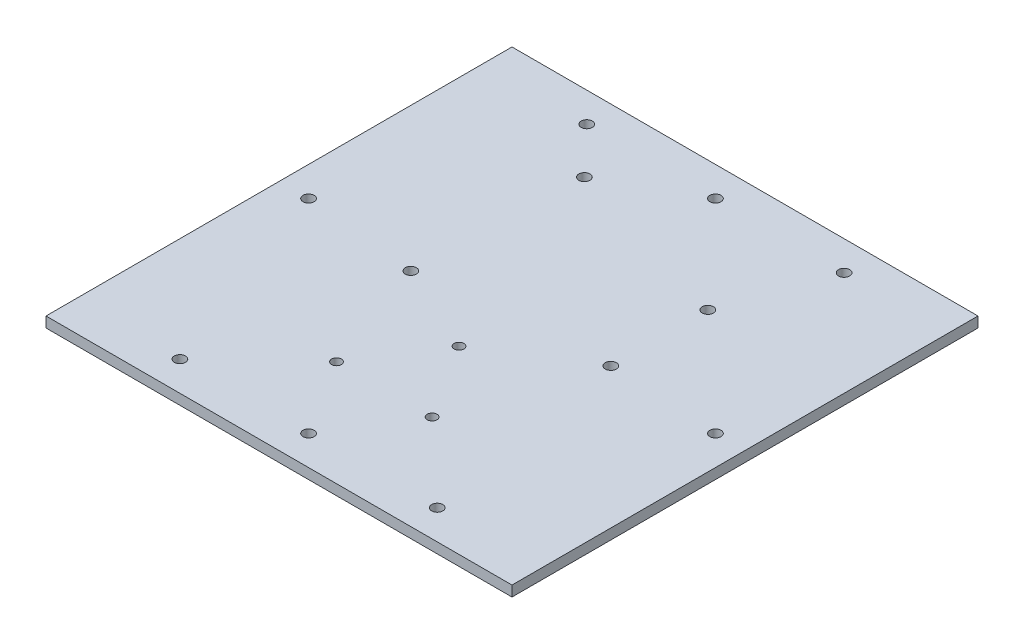
ISO-10303-21;
HEADER;
FILE_DESCRIPTION(('STEP AP214'),'2;1');
FILE_NAME('part.step','',(''),(''),'','','');
FILE_SCHEMA(('AUTOMOTIVE_DESIGN { 1 0 10303 214 1 1 1 1 }'));
ENDSEC;
DATA;
#1=APPLICATION_CONTEXT('core data for automotive mechanical design processes');
#2=APPLICATION_PROTOCOL_DEFINITION('international standard','automotive_design',2000,#1);
#3=PRODUCT_CONTEXT('',#1,'mechanical');
#4=PRODUCT('Part','Part','',(#3));
#5=PRODUCT_RELATED_PRODUCT_CATEGORY('part','',(#4));
#6=PRODUCT_DEFINITION_FORMATION('','',#4);
#7=PRODUCT_DEFINITION_CONTEXT('part definition',#1,'design');
#8=PRODUCT_DEFINITION('design','',#6,#7);
#9=PRODUCT_DEFINITION_SHAPE('','',#8);
#10=(LENGTH_UNIT() NAMED_UNIT(*) SI_UNIT(.MILLI.,.METRE.));
#11=(NAMED_UNIT(*) PLANE_ANGLE_UNIT() SI_UNIT($,.RADIAN.));
#12=(NAMED_UNIT(*) SI_UNIT($,.STERADIAN.) SOLID_ANGLE_UNIT());
#13=UNCERTAINTY_MEASURE_WITH_UNIT(LENGTH_MEASURE(1.E-05),#10,'distance_accuracy_value','');
#14=(GEOMETRIC_REPRESENTATION_CONTEXT(3) GLOBAL_UNCERTAINTY_ASSIGNED_CONTEXT((#13)) GLOBAL_UNIT_ASSIGNED_CONTEXT((#10,
#11,#12)) REPRESENTATION_CONTEXT('',''));
#15=CARTESIAN_POINT('',(0.,0.,0.));
#16=DIRECTION('',(0.,0.,1.));
#17=DIRECTION('',(1.,0.,0.));
#18=AXIS2_PLACEMENT_3D('',#15,#16,#17);
#19=CARTESIAN_POINT('',(67.,3.,0.));
#20=DIRECTION('',(1.,0.,0.));
#21=DIRECTION('',(0.,0.,-1.));
#22=AXIS2_PLACEMENT_3D('',#19,#20,#21);
#23=PLANE('',#22);
#24=DIRECTION('',(0.,0.,1.));
#25=VECTOR('',#24,1.);
#26=CARTESIAN_POINT('',(67.,0.,0.));
#27=LINE('',#26,#25);
#28=CARTESIAN_POINT('',(67.,0.,-67.));
#29=VERTEX_POINT('',#28);
#30=CARTESIAN_POINT('',(67.,0.,67.));
#31=VERTEX_POINT('',#30);
#32=EDGE_CURVE('E152',#29,#31,#27,.T.);
#33=ORIENTED_EDGE('',*,*,#32,.F.);
#34=DIRECTION('',(0.,-1.,0.));
#35=VECTOR('',#34,1.);
#36=CARTESIAN_POINT('',(67.,3.,-67.));
#37=LINE('',#36,#35);
#38=CARTESIAN_POINT('',(67.,3.,-67.));
#39=VERTEX_POINT('',#38);
#40=EDGE_CURVE('E11',#39,#29,#37,.T.);
#41=ORIENTED_EDGE('',*,*,#40,.F.);
#42=DIRECTION('',(0.,0.,1.));
#43=VECTOR('',#42,1.);
#44=CARTESIAN_POINT('',(67.,3.,0.));
#45=LINE('',#44,#43);
#46=CARTESIAN_POINT('',(67.,3.,67.));
#47=VERTEX_POINT('',#46);
#48=EDGE_CURVE('E100',#39,#47,#45,.T.);
#49=ORIENTED_EDGE('',*,*,#48,.T.);
#50=DIRECTION('',(0.,-1.,0.));
#51=VECTOR('',#50,1.);
#52=CARTESIAN_POINT('',(67.,3.,67.));
#53=LINE('',#52,#51);
#54=EDGE_CURVE('E78',#47,#31,#53,.T.);
#55=ORIENTED_EDGE('',*,*,#54,.T.);
#56=EDGE_LOOP('',(#33,#41,#49,#55));
#57=FACE_BOUND('',#56,.T.);
#58=ADVANCED_FACE('F38',(#57),#23,.T.);
#59=CARTESIAN_POINT('',(0.,3.,-66.9999999999999));
#60=DIRECTION('',(0.,0.,-1.));
#61=DIRECTION('',(-1.,0.,0.));
#62=AXIS2_PLACEMENT_3D('',#59,#60,#61);
#63=PLANE('',#62);
#64=DIRECTION('',(1.,0.,0.));
#65=VECTOR('',#64,1.);
#66=CARTESIAN_POINT('',(0.,0.,-66.9999999999999));
#67=LINE('',#66,#65);
#68=CARTESIAN_POINT('',(-67.0000000000002,0.,-66.9999999999999));
#69=VERTEX_POINT('',#68);
#70=EDGE_CURVE('E90',#69,#29,#67,.T.);
#71=ORIENTED_EDGE('',*,*,#70,.F.);
#72=DIRECTION('',(0.,-1.,0.));
#73=VECTOR('',#72,1.);
#74=CARTESIAN_POINT('',(-67.0000000000002,3.,-66.9999999999999));
#75=LINE('',#74,#73);
#76=CARTESIAN_POINT('',(-67.0000000000002,3.,-66.9999999999999));
#77=VERTEX_POINT('',#76);
#78=EDGE_CURVE('E47',#77,#69,#75,.T.);
#79=ORIENTED_EDGE('',*,*,#78,.F.);
#80=DIRECTION('',(1.,0.,0.));
#81=VECTOR('',#80,1.);
#82=CARTESIAN_POINT('',(0.,3.,-66.9999999999999));
#83=LINE('',#82,#81);
#84=EDGE_CURVE('E88',#77,#39,#83,.T.);
#85=ORIENTED_EDGE('',*,*,#84,.T.);
#86=ORIENTED_EDGE('',*,*,#40,.T.);
#87=EDGE_LOOP('',(#71,#79,#85,#86));
#88=FACE_BOUND('',#87,.T.);
#89=ADVANCED_FACE('F86',(#88),#63,.T.);
#90=CARTESIAN_POINT('',(-67.0000000000001,3.,0.));
#91=DIRECTION('',(1.,0.,0.));
#92=DIRECTION('',(0.,0.,-1.));
#93=AXIS2_PLACEMENT_3D('',#90,#91,#92);
#94=PLANE('',#93);
#95=DIRECTION('',(0.,0.,1.));
#96=VECTOR('',#95,1.);
#97=CARTESIAN_POINT('',(-67.0000000000001,0.,0.));
#98=LINE('',#97,#96);
#99=CARTESIAN_POINT('',(-67.,0.,67.));
#100=VERTEX_POINT('',#99);
#101=EDGE_CURVE('E155',#69,#100,#98,.T.);
#102=ORIENTED_EDGE('',*,*,#101,.T.);
#103=DIRECTION('',(0.,-1.,0.));
#104=VECTOR('',#103,1.);
#105=CARTESIAN_POINT('',(-67.,3.,67.));
#106=LINE('',#105,#104);
#107=CARTESIAN_POINT('',(-67.,3.,67.));
#108=VERTEX_POINT('',#107);
#109=EDGE_CURVE('E93',#108,#100,#106,.T.);
#110=ORIENTED_EDGE('',*,*,#109,.F.);
#111=DIRECTION('',(0.,0.,1.));
#112=VECTOR('',#111,1.);
#113=CARTESIAN_POINT('',(-67.0000000000001,3.,0.));
#114=LINE('',#113,#112);
#115=EDGE_CURVE('E95',#77,#108,#114,.T.);
#116=ORIENTED_EDGE('',*,*,#115,.F.);
#117=ORIENTED_EDGE('',*,*,#78,.T.);
#118=EDGE_LOOP('',(#102,#110,#116,#117));
#119=FACE_BOUND('',#118,.T.);
#120=ADVANCED_FACE('F96',(#119),#94,.F.);
#121=CARTESIAN_POINT('',(-13.8303840868332,3.,36.6434533604129));
#122=DIRECTION('',(0.,-1.,0.));
#123=DIRECTION('',(0.,0.,-1.));
#124=AXIS2_PLACEMENT_3D('',#121,#122,#123);
#125=CYLINDRICAL_SURFACE('',#124,1.4);
#126=CARTESIAN_POINT('',(-13.8303840868332,3.,36.6434533604129));
#127=DIRECTION('',(0.,1.,0.));
#128=DIRECTION('',(0.,0.,1.));
#129=AXIS2_PLACEMENT_3D('',#126,#127,#128);
#130=CIRCLE('',#129,1.4);
#131=CARTESIAN_POINT('',(-13.8303840868332,3.,38.0434533604129));
#132=VERTEX_POINT('',#131);
#133=EDGE_CURVE('E122',#132,#132,#130,.T.);
#134=ORIENTED_EDGE('',*,*,#133,.T.);
#135=EDGE_LOOP('',(#134));
#136=FACE_BOUND('',#135,.T.);
#137=CARTESIAN_POINT('',(-13.8303840868332,0.,36.6434533604129));
#138=DIRECTION('',(0.,1.,0.));
#139=DIRECTION('',(0.,0.,1.));
#140=AXIS2_PLACEMENT_3D('',#137,#138,#139);
#141=CIRCLE('',#140,1.4);
#142=CARTESIAN_POINT('',(-13.8303840868332,0.,38.0434533604129));
#143=VERTEX_POINT('',#142);
#144=EDGE_CURVE('E173',#143,#143,#141,.T.);
#145=ORIENTED_EDGE('',*,*,#144,.F.);
#146=EDGE_LOOP('',(#145));
#147=FACE_BOUND('',#146,.T.);
#148=ADVANCED_FACE('F260',(#136,#147),#125,.F.);
#149=CARTESIAN_POINT('',(13.6696159131668,3.,36.6434533604129));
#150=DIRECTION('',(0.,-1.,0.));
#151=DIRECTION('',(0.,0.,-1.));
#152=AXIS2_PLACEMENT_3D('',#149,#150,#151);
#153=CYLINDRICAL_SURFACE('',#152,1.4);
#154=CARTESIAN_POINT('',(13.6696159131668,3.,36.6434533604129));
#155=DIRECTION('',(0.,1.,0.));
#156=DIRECTION('',(0.,0.,1.));
#157=AXIS2_PLACEMENT_3D('',#154,#155,#156);
#158=CIRCLE('',#157,1.4);
#159=CARTESIAN_POINT('',(13.6696159131668,3.,38.0434533604129));
#160=VERTEX_POINT('',#159);
#161=EDGE_CURVE('E119',#160,#160,#158,.T.);
#162=ORIENTED_EDGE('',*,*,#161,.T.);
#163=EDGE_LOOP('',(#162));
#164=FACE_BOUND('',#163,.T.);
#165=CARTESIAN_POINT('',(13.6696159131668,0.,36.6434533604129));
#166=DIRECTION('',(0.,1.,0.));
#167=DIRECTION('',(0.,0.,1.));
#168=AXIS2_PLACEMENT_3D('',#165,#166,#167);
#169=CIRCLE('',#168,1.4);
#170=CARTESIAN_POINT('',(13.6696159131668,0.,38.0434533604129));
#171=VERTEX_POINT('',#170);
#172=EDGE_CURVE('E170',#171,#171,#169,.T.);
#173=ORIENTED_EDGE('',*,*,#172,.F.);
#174=EDGE_LOOP('',(#173));
#175=FACE_BOUND('',#174,.T.);
#176=ADVANCED_FACE('F263',(#164,#175),#153,.F.);
#177=CARTESIAN_POINT('',(-24.1653955822405,3.,-44.9845483771181));
#178=DIRECTION('',(0.,-1.,0.));
#179=DIRECTION('',(0.,0.,-1.));
#180=AXIS2_PLACEMENT_3D('',#177,#178,#179);
#181=CYLINDRICAL_SURFACE('',#180,1.60000000000001);
#182=CARTESIAN_POINT('',(-24.1653955822405,3.,-44.9845483771181));
#183=DIRECTION('',(0.,1.,0.));
#184=DIRECTION('',(0.,0.,1.));
#185=AXIS2_PLACEMENT_3D('',#182,#183,#184);
#186=CIRCLE('',#185,1.60000000000001);
#187=CARTESIAN_POINT('',(-24.1653955822405,3.,-43.384548377118));
#188=VERTEX_POINT('',#187);
#189=EDGE_CURVE('E116',#188,#188,#186,.T.);
#190=ORIENTED_EDGE('',*,*,#189,.T.);
#191=EDGE_LOOP('',(#190));
#192=FACE_BOUND('',#191,.T.);
#193=CARTESIAN_POINT('',(-24.1653955822405,0.,-44.9845483771181));
#194=DIRECTION('',(0.,1.,0.));
#195=DIRECTION('',(0.,0.,1.));
#196=AXIS2_PLACEMENT_3D('',#193,#194,#195);
#197=CIRCLE('',#196,1.60000000000001);
#198=CARTESIAN_POINT('',(-24.1653955822405,0.,-43.384548377118));
#199=VERTEX_POINT('',#198);
#200=EDGE_CURVE('E167',#199,#199,#197,.T.);
#201=ORIENTED_EDGE('',*,*,#200,.F.);
#202=EDGE_LOOP('',(#201));
#203=FACE_BOUND('',#202,.T.);
#204=ADVANCED_FACE('F267',(#192,#203),#181,.F.);
#205=CARTESIAN_POINT('',(26.6346044177595,3.,-29.6845483771181));
#206=DIRECTION('',(0.,-1.,0.));
#207=DIRECTION('',(0.,0.,-1.));
#208=AXIS2_PLACEMENT_3D('',#205,#206,#207);
#209=CYLINDRICAL_SURFACE('',#208,1.60000000000002);
#210=CARTESIAN_POINT('',(26.6346044177595,3.,-29.6845483771181));
#211=DIRECTION('',(0.,1.,0.));
#212=DIRECTION('',(0.,0.,1.));
#213=AXIS2_PLACEMENT_3D('',#210,#211,#212);
#214=CIRCLE('',#213,1.60000000000002);
#215=CARTESIAN_POINT('',(26.6346044177595,3.,-28.0845483771181));
#216=VERTEX_POINT('',#215);
#217=EDGE_CURVE('E113',#216,#216,#214,.T.);
#218=ORIENTED_EDGE('',*,*,#217,.T.);
#219=EDGE_LOOP('',(#218));
#220=FACE_BOUND('',#219,.T.);
#221=CARTESIAN_POINT('',(26.6346044177595,0.,-29.6845483771181));
#222=DIRECTION('',(0.,1.,0.));
#223=DIRECTION('',(0.,0.,1.));
#224=AXIS2_PLACEMENT_3D('',#221,#222,#223);
#225=CIRCLE('',#224,1.60000000000002);
#226=CARTESIAN_POINT('',(26.6346044177595,0.,-28.0845483771181));
#227=VERTEX_POINT('',#226);
#228=EDGE_CURVE('E164',#227,#227,#225,.T.);
#229=ORIENTED_EDGE('',*,*,#228,.F.);
#230=EDGE_LOOP('',(#229));
#231=FACE_BOUND('',#230,.T.);
#232=ADVANCED_FACE('F271',(#220,#231),#209,.F.);
#233=CARTESIAN_POINT('',(-25.7653955822406,3.,3.31545162288194));
#234=DIRECTION('',(0.,-1.,0.));
#235=DIRECTION('',(0.,0.,-1.));
#236=AXIS2_PLACEMENT_3D('',#233,#234,#235);
#237=CYLINDRICAL_SURFACE('',#236,1.60000000000001);
#238=CARTESIAN_POINT('',(-25.7653955822406,3.,3.31545162288194));
#239=DIRECTION('',(0.,1.,0.));
#240=DIRECTION('',(0.,0.,1.));
#241=AXIS2_PLACEMENT_3D('',#238,#239,#240);
#242=CIRCLE('',#241,1.60000000000001);
#243=CARTESIAN_POINT('',(-25.7653955822406,3.,4.91545162288194));
#244=VERTEX_POINT('',#243);
#245=EDGE_CURVE('E110',#244,#244,#242,.T.);
#246=ORIENTED_EDGE('',*,*,#245,.T.);
#247=EDGE_LOOP('',(#246));
#248=FACE_BOUND('',#247,.T.);
#249=CARTESIAN_POINT('',(-25.7653955822406,0.,3.31545162288194));
#250=DIRECTION('',(0.,1.,0.));
#251=DIRECTION('',(0.,0.,1.));
#252=AXIS2_PLACEMENT_3D('',#249,#250,#251);
#253=CIRCLE('',#252,1.60000000000001);
#254=CARTESIAN_POINT('',(-25.7653955822406,0.,4.91545162288194));
#255=VERTEX_POINT('',#254);
#256=EDGE_CURVE('E161',#255,#255,#253,.T.);
#257=ORIENTED_EDGE('',*,*,#256,.F.);
#258=EDGE_LOOP('',(#257));
#259=FACE_BOUND('',#258,.T.);
#260=ADVANCED_FACE('F275',(#248,#259),#237,.F.);
#261=CARTESIAN_POINT('',(26.6346044177595,3.,-1.78454837711807));
#262=DIRECTION('',(0.,-1.,0.));
#263=DIRECTION('',(0.,0.,-1.));
#264=AXIS2_PLACEMENT_3D('',#261,#262,#263);
#265=CYLINDRICAL_SURFACE('',#264,1.60000000000002);
#266=CARTESIAN_POINT('',(26.6346044177595,3.,-1.78454837711807));
#267=DIRECTION('',(0.,1.,0.));
#268=DIRECTION('',(0.,0.,1.));
#269=AXIS2_PLACEMENT_3D('',#266,#267,#268);
#270=CIRCLE('',#269,1.60000000000002);
#271=CARTESIAN_POINT('',(26.6346044177595,3.,-0.184548377118048));
#272=VERTEX_POINT('',#271);
#273=EDGE_CURVE('E107',#272,#272,#270,.T.);
#274=ORIENTED_EDGE('',*,*,#273,.T.);
#275=EDGE_LOOP('',(#274));
#276=FACE_BOUND('',#275,.T.);
#277=CARTESIAN_POINT('',(26.6346044177595,0.,-1.78454837711807));
#278=DIRECTION('',(0.,1.,0.));
#279=DIRECTION('',(0.,0.,1.));
#280=AXIS2_PLACEMENT_3D('',#277,#278,#279);
#281=CIRCLE('',#280,1.60000000000002);
#282=CARTESIAN_POINT('',(26.6346044177595,0.,-0.184548377118048));
#283=VERTEX_POINT('',#282);
#284=EDGE_CURVE('E158',#283,#283,#281,.T.);
#285=ORIENTED_EDGE('',*,*,#284,.F.);
#286=EDGE_LOOP('',(#285));
#287=FACE_BOUND('',#286,.T.);
#288=ADVANCED_FACE('F279',(#276,#287),#265,.F.);
#289=CARTESIAN_POINT('',(0.,3.,67.));
#290=DIRECTION('',(0.,0.,-1.));
#291=DIRECTION('',(-1.,0.,0.));
#292=AXIS2_PLACEMENT_3D('',#289,#290,#291);
#293=PLANE('',#292);
#294=DIRECTION('',(1.,0.,0.));
#295=VECTOR('',#294,1.);
#296=CARTESIAN_POINT('',(0.,0.,67.));
#297=LINE('',#296,#295);
#298=EDGE_CURVE('E71',#100,#31,#297,.T.);
#299=ORIENTED_EDGE('',*,*,#298,.T.);
#300=ORIENTED_EDGE('',*,*,#54,.F.);
#301=DIRECTION('',(1.,0.,0.));
#302=VECTOR('',#301,1.);
#303=CARTESIAN_POINT('',(0.,3.,67.));
#304=LINE('',#303,#302);
#305=EDGE_CURVE('E55',#108,#47,#304,.T.);
#306=ORIENTED_EDGE('',*,*,#305,.F.);
#307=ORIENTED_EDGE('',*,*,#109,.T.);
#308=EDGE_LOOP('',(#299,#300,#306,#307));
#309=FACE_BOUND('',#308,.T.);
#310=ADVANCED_FACE('F182',(#309),#293,.F.);
#311=CARTESIAN_POINT('',(0.,3.,-58.4999999999999));
#312=DIRECTION('',(0.,-1.,0.));
#313=DIRECTION('',(0.,0.,-1.));
#314=AXIS2_PLACEMENT_3D('',#311,#312,#313);
#315=CYLINDRICAL_SURFACE('',#314,1.60000000000002);
#316=CARTESIAN_POINT('',(0.,3.,-58.4999999999999));
#317=DIRECTION('',(0.,1.,0.));
#318=DIRECTION('',(0.,0.,1.));
#319=AXIS2_PLACEMENT_3D('',#316,#317,#318);
#320=CIRCLE('',#319,1.60000000000002);
#321=CARTESIAN_POINT('',(0.,3.,-56.8999999999999));
#322=VERTEX_POINT('',#321);
#323=EDGE_CURVE('E102',#322,#322,#320,.T.);
#324=ORIENTED_EDGE('',*,*,#323,.T.);
#325=EDGE_LOOP('',(#324));
#326=FACE_BOUND('',#325,.T.);
#327=CARTESIAN_POINT('',(0.,0.,-58.4999999999999));
#328=DIRECTION('',(0.,1.,0.));
#329=DIRECTION('',(0.,0.,1.));
#330=AXIS2_PLACEMENT_3D('',#327,#328,#329);
#331=CIRCLE('',#330,1.60000000000002);
#332=CARTESIAN_POINT('',(0.,0.,-56.8999999999999));
#333=VERTEX_POINT('',#332);
#334=EDGE_CURVE('E149',#333,#333,#331,.T.);
#335=ORIENTED_EDGE('',*,*,#334,.F.);
#336=EDGE_LOOP('',(#335));
#337=FACE_BOUND('',#336,.T.);
#338=ADVANCED_FACE('F193',(#326,#337),#315,.F.);
#339=CARTESIAN_POINT('',(-58.5,3.,0.));
#340=DIRECTION('',(0.,-1.,0.));
#341=DIRECTION('',(0.,0.,-1.));
#342=AXIS2_PLACEMENT_3D('',#339,#340,#341);
#343=CYLINDRICAL_SURFACE('',#342,1.60000000000002);
#344=CARTESIAN_POINT('',(-58.5,3.,0.));
#345=DIRECTION('',(0.,1.,0.));
#346=DIRECTION('',(0.,0.,1.));
#347=AXIS2_PLACEMENT_3D('',#344,#345,#346);
#348=CIRCLE('',#347,1.60000000000002);
#349=CARTESIAN_POINT('',(-58.5,3.,1.60000000000008));
#350=VERTEX_POINT('',#349);
#351=EDGE_CURVE('E488',#350,#350,#348,.T.);
#352=ORIENTED_EDGE('',*,*,#351,.T.);
#353=EDGE_LOOP('',(#352));
#354=FACE_BOUND('',#353,.T.);
#355=CARTESIAN_POINT('',(-58.5,0.,0.));
#356=DIRECTION('',(0.,1.,0.));
#357=DIRECTION('',(0.,0.,1.));
#358=AXIS2_PLACEMENT_3D('',#355,#356,#357);
#359=CIRCLE('',#358,1.60000000000002);
#360=CARTESIAN_POINT('',(-58.5,0.,1.60000000000008));
#361=VERTEX_POINT('',#360);
#362=EDGE_CURVE('E146',#361,#361,#359,.T.);
#363=ORIENTED_EDGE('',*,*,#362,.F.);
#364=EDGE_LOOP('',(#363));
#365=FACE_BOUND('',#364,.T.);
#366=ADVANCED_FACE('F196',(#354,#365),#343,.F.);
#367=CARTESIAN_POINT('',(0.,3.,58.5));
#368=DIRECTION('',(0.,-1.,0.));
#369=DIRECTION('',(0.,0.,-1.));
#370=AXIS2_PLACEMENT_3D('',#367,#368,#369);
#371=CYLINDRICAL_SURFACE('',#370,1.60000000000002);
#372=CARTESIAN_POINT('',(0.,3.,58.5));
#373=DIRECTION('',(0.,1.,0.));
#374=DIRECTION('',(0.,0.,1.));
#375=AXIS2_PLACEMENT_3D('',#372,#373,#374);
#376=CIRCLE('',#375,1.60000000000002);
#377=CARTESIAN_POINT('',(0.,3.,60.1));
#378=VERTEX_POINT('',#377);
#379=EDGE_CURVE('E484',#378,#378,#376,.T.);
#380=ORIENTED_EDGE('',*,*,#379,.T.);
#381=EDGE_LOOP('',(#380));
#382=FACE_BOUND('',#381,.T.);
#383=CARTESIAN_POINT('',(0.,0.,58.5));
#384=DIRECTION('',(0.,1.,0.));
#385=DIRECTION('',(0.,0.,1.));
#386=AXIS2_PLACEMENT_3D('',#383,#384,#385);
#387=CIRCLE('',#386,1.60000000000002);
#388=CARTESIAN_POINT('',(0.,0.,60.1));
#389=VERTEX_POINT('',#388);
#390=EDGE_CURVE('E143',#389,#389,#387,.T.);
#391=ORIENTED_EDGE('',*,*,#390,.F.);
#392=EDGE_LOOP('',(#391));
#393=FACE_BOUND('',#392,.T.);
#394=ADVANCED_FACE('F200',(#382,#393),#371,.F.);
#395=CARTESIAN_POINT('',(58.5,3.,0.));
#396=DIRECTION('',(0.,-1.,0.));
#397=DIRECTION('',(0.,0.,-1.));
#398=AXIS2_PLACEMENT_3D('',#395,#396,#397);
#399=CYLINDRICAL_SURFACE('',#398,1.60000000000002);
#400=CARTESIAN_POINT('',(58.5,3.,0.));
#401=DIRECTION('',(0.,1.,0.));
#402=DIRECTION('',(0.,0.,1.));
#403=AXIS2_PLACEMENT_3D('',#400,#401,#402);
#404=CIRCLE('',#403,1.60000000000002);
#405=CARTESIAN_POINT('',(58.5,3.,1.60000000000009));
#406=VERTEX_POINT('',#405);
#407=EDGE_CURVE('E480',#406,#406,#404,.T.);
#408=ORIENTED_EDGE('',*,*,#407,.T.);
#409=EDGE_LOOP('',(#408));
#410=FACE_BOUND('',#409,.T.);
#411=CARTESIAN_POINT('',(58.5,0.,0.));
#412=DIRECTION('',(0.,1.,0.));
#413=DIRECTION('',(0.,0.,1.));
#414=AXIS2_PLACEMENT_3D('',#411,#412,#413);
#415=CIRCLE('',#414,1.60000000000002);
#416=CARTESIAN_POINT('',(58.5,0.,1.60000000000009));
#417=VERTEX_POINT('',#416);
#418=EDGE_CURVE('E140',#417,#417,#415,.T.);
#419=ORIENTED_EDGE('',*,*,#418,.F.);
#420=EDGE_LOOP('',(#419));
#421=FACE_BOUND('',#420,.T.);
#422=ADVANCED_FACE('F204',(#410,#421),#399,.F.);
#423=CARTESIAN_POINT('',(-37.,3.,-58.4999999999999));
#424=DIRECTION('',(0.,-1.,0.));
#425=DIRECTION('',(0.,0.,-1.));
#426=AXIS2_PLACEMENT_3D('',#423,#424,#425);
#427=CYLINDRICAL_SURFACE('',#426,1.60000000000002);
#428=CARTESIAN_POINT('',(-37.,3.,-58.4999999999999));
#429=DIRECTION('',(0.,1.,0.));
#430=DIRECTION('',(0.,0.,1.));
#431=AXIS2_PLACEMENT_3D('',#428,#429,#430);
#432=CIRCLE('',#431,1.60000000000002);
#433=CARTESIAN_POINT('',(-37.,3.,-56.8999999999999));
#434=VERTEX_POINT('',#433);
#435=EDGE_CURVE('E476',#434,#434,#432,.T.);
#436=ORIENTED_EDGE('',*,*,#435,.T.);
#437=EDGE_LOOP('',(#436));
#438=FACE_BOUND('',#437,.T.);
#439=CARTESIAN_POINT('',(-37.,0.,-58.4999999999999));
#440=DIRECTION('',(0.,1.,0.));
#441=DIRECTION('',(0.,0.,1.));
#442=AXIS2_PLACEMENT_3D('',#439,#440,#441);
#443=CIRCLE('',#442,1.60000000000002);
#444=CARTESIAN_POINT('',(-37.,0.,-56.8999999999999));
#445=VERTEX_POINT('',#444);
#446=EDGE_CURVE('E137',#445,#445,#443,.T.);
#447=ORIENTED_EDGE('',*,*,#446,.F.);
#448=EDGE_LOOP('',(#447));
#449=FACE_BOUND('',#448,.T.);
#450=ADVANCED_FACE('F208',(#438,#449),#427,.F.);
#451=CARTESIAN_POINT('',(36.9999999999999,3.,-58.4999999999999));
#452=DIRECTION('',(0.,-1.,0.));
#453=DIRECTION('',(0.,0.,-1.));
#454=AXIS2_PLACEMENT_3D('',#451,#452,#453);
#455=CYLINDRICAL_SURFACE('',#454,1.60000000000002);
#456=CARTESIAN_POINT('',(36.9999999999999,3.,-58.4999999999999));
#457=DIRECTION('',(0.,1.,0.));
#458=DIRECTION('',(0.,0.,1.));
#459=AXIS2_PLACEMENT_3D('',#456,#457,#458);
#460=CIRCLE('',#459,1.60000000000002);
#461=CARTESIAN_POINT('',(36.9999999999999,3.,-56.8999999999999));
#462=VERTEX_POINT('',#461);
#463=EDGE_CURVE('E472',#462,#462,#460,.T.);
#464=ORIENTED_EDGE('',*,*,#463,.T.);
#465=EDGE_LOOP('',(#464));
#466=FACE_BOUND('',#465,.T.);
#467=CARTESIAN_POINT('',(36.9999999999999,0.,-58.4999999999999));
#468=DIRECTION('',(0.,1.,0.));
#469=DIRECTION('',(0.,0.,1.));
#470=AXIS2_PLACEMENT_3D('',#467,#468,#469);
#471=CIRCLE('',#470,1.60000000000002);
#472=CARTESIAN_POINT('',(36.9999999999999,0.,-56.8999999999999));
#473=VERTEX_POINT('',#472);
#474=EDGE_CURVE('E134',#473,#473,#471,.T.);
#475=ORIENTED_EDGE('',*,*,#474,.F.);
#476=EDGE_LOOP('',(#475));
#477=FACE_BOUND('',#476,.T.);
#478=ADVANCED_FACE('F212',(#466,#477),#455,.F.);
#479=CARTESIAN_POINT('',(-37.,3.,58.5));
#480=DIRECTION('',(0.,-1.,0.));
#481=DIRECTION('',(0.,0.,-1.));
#482=AXIS2_PLACEMENT_3D('',#479,#480,#481);
#483=CYLINDRICAL_SURFACE('',#482,1.60000000000002);
#484=CARTESIAN_POINT('',(-37.,3.,58.5));
#485=DIRECTION('',(0.,1.,0.));
#486=DIRECTION('',(0.,0.,1.));
#487=AXIS2_PLACEMENT_3D('',#484,#485,#486);
#488=CIRCLE('',#487,1.60000000000002);
#489=CARTESIAN_POINT('',(-37.,3.,60.1));
#490=VERTEX_POINT('',#489);
#491=EDGE_CURVE('E227',#490,#490,#488,.T.);
#492=ORIENTED_EDGE('',*,*,#491,.T.);
#493=EDGE_LOOP('',(#492));
#494=FACE_BOUND('',#493,.T.);
#495=CARTESIAN_POINT('',(-37.,0.,58.5));
#496=DIRECTION('',(0.,1.,0.));
#497=DIRECTION('',(0.,0.,1.));
#498=AXIS2_PLACEMENT_3D('',#495,#496,#497);
#499=CIRCLE('',#498,1.60000000000002);
#500=CARTESIAN_POINT('',(-37.,0.,60.1));
#501=VERTEX_POINT('',#500);
#502=EDGE_CURVE('E131',#501,#501,#499,.T.);
#503=ORIENTED_EDGE('',*,*,#502,.F.);
#504=EDGE_LOOP('',(#503));
#505=FACE_BOUND('',#504,.T.);
#506=ADVANCED_FACE('F215',(#494,#505),#483,.F.);
#507=CARTESIAN_POINT('',(36.9999999999999,3.,58.5));
#508=DIRECTION('',(0.,-1.,0.));
#509=DIRECTION('',(0.,0.,-1.));
#510=AXIS2_PLACEMENT_3D('',#507,#508,#509);
#511=CYLINDRICAL_SURFACE('',#510,1.60000000000002);
#512=CARTESIAN_POINT('',(36.9999999999999,3.,58.5));
#513=DIRECTION('',(0.,1.,0.));
#514=DIRECTION('',(0.,0.,1.));
#515=AXIS2_PLACEMENT_3D('',#512,#513,#514);
#516=CIRCLE('',#515,1.60000000000002);
#517=CARTESIAN_POINT('',(36.9999999999999,3.,60.1));
#518=VERTEX_POINT('',#517);
#519=EDGE_CURVE('E179',#518,#518,#516,.T.);
#520=ORIENTED_EDGE('',*,*,#519,.T.);
#521=EDGE_LOOP('',(#520));
#522=FACE_BOUND('',#521,.T.);
#523=CARTESIAN_POINT('',(36.9999999999999,0.,58.5));
#524=DIRECTION('',(0.,1.,0.));
#525=DIRECTION('',(0.,0.,1.));
#526=AXIS2_PLACEMENT_3D('',#523,#524,#525);
#527=CIRCLE('',#526,1.60000000000002);
#528=CARTESIAN_POINT('',(36.9999999999999,0.,60.1));
#529=VERTEX_POINT('',#528);
#530=EDGE_CURVE('E128',#529,#529,#527,.T.);
#531=ORIENTED_EDGE('',*,*,#530,.F.);
#532=EDGE_LOOP('',(#531));
#533=FACE_BOUND('',#532,.T.);
#534=ADVANCED_FACE('F40',(#522,#533),#511,.F.);
#535=CARTESIAN_POINT('',(-0.0803840868331803,3.,15.1434533604129));
#536=DIRECTION('',(0.,-1.,0.));
#537=DIRECTION('',(0.,0.,-1.));
#538=AXIS2_PLACEMENT_3D('',#535,#536,#537);
#539=CYLINDRICAL_SURFACE('',#538,1.4);
#540=CARTESIAN_POINT('',(-0.0803840868331803,3.,15.1434533604129));
#541=DIRECTION('',(0.,1.,0.));
#542=DIRECTION('',(0.,0.,1.));
#543=AXIS2_PLACEMENT_3D('',#540,#541,#542);
#544=CIRCLE('',#543,1.4);
#545=CARTESIAN_POINT('',(-0.0803840868331803,3.,16.5434533604129));
#546=VERTEX_POINT('',#545);
#547=EDGE_CURVE('E125',#546,#546,#544,.T.);
#548=ORIENTED_EDGE('',*,*,#547,.T.);
#549=EDGE_LOOP('',(#548));
#550=FACE_BOUND('',#549,.T.);
#551=CARTESIAN_POINT('',(-0.0803840868331803,0.,15.1434533604129));
#552=DIRECTION('',(0.,1.,0.));
#553=DIRECTION('',(0.,0.,1.));
#554=AXIS2_PLACEMENT_3D('',#551,#552,#553);
#555=CIRCLE('',#554,1.4);
#556=CARTESIAN_POINT('',(-0.0803840868331803,0.,16.5434533604129));
#557=VERTEX_POINT('',#556);
#558=EDGE_CURVE('E176',#557,#557,#555,.T.);
#559=ORIENTED_EDGE('',*,*,#558,.F.);
#560=EDGE_LOOP('',(#559));
#561=FACE_BOUND('',#560,.T.);
#562=ADVANCED_FACE('F222',(#550,#561),#539,.F.);
#563=CARTESIAN_POINT('',(0.,3.,0.));
#564=DIRECTION('',(0.,1.,0.));
#565=DIRECTION('',(0.,0.,1.));
#566=AXIS2_PLACEMENT_3D('',#563,#564,#565);
#567=PLANE('',#566);
#568=ORIENTED_EDGE('',*,*,#519,.F.);
#569=EDGE_LOOP('',(#568));
#570=FACE_BOUND('',#569,.T.);
#571=ORIENTED_EDGE('',*,*,#491,.F.);
#572=EDGE_LOOP('',(#571));
#573=FACE_BOUND('',#572,.T.);
#574=ORIENTED_EDGE('',*,*,#463,.F.);
#575=EDGE_LOOP('',(#574));
#576=FACE_BOUND('',#575,.T.);
#577=ORIENTED_EDGE('',*,*,#435,.F.);
#578=EDGE_LOOP('',(#577));
#579=FACE_BOUND('',#578,.T.);
#580=ORIENTED_EDGE('',*,*,#407,.F.);
#581=EDGE_LOOP('',(#580));
#582=FACE_BOUND('',#581,.T.);
#583=ORIENTED_EDGE('',*,*,#379,.F.);
#584=EDGE_LOOP('',(#583));
#585=FACE_BOUND('',#584,.T.);
#586=ORIENTED_EDGE('',*,*,#351,.F.);
#587=EDGE_LOOP('',(#586));
#588=FACE_BOUND('',#587,.T.);
#589=ORIENTED_EDGE('',*,*,#323,.F.);
#590=EDGE_LOOP('',(#589));
#591=FACE_BOUND('',#590,.T.);
#592=ORIENTED_EDGE('',*,*,#48,.F.);
#593=ORIENTED_EDGE('',*,*,#84,.F.);
#594=ORIENTED_EDGE('',*,*,#115,.T.);
#595=ORIENTED_EDGE('',*,*,#305,.T.);
#596=EDGE_LOOP('',(#592,#593,#594,#595));
#597=FACE_BOUND('',#596,.T.);
#598=ORIENTED_EDGE('',*,*,#273,.F.);
#599=EDGE_LOOP('',(#598));
#600=FACE_BOUND('',#599,.T.);
#601=ORIENTED_EDGE('',*,*,#245,.F.);
#602=EDGE_LOOP('',(#601));
#603=FACE_BOUND('',#602,.T.);
#604=ORIENTED_EDGE('',*,*,#217,.F.);
#605=EDGE_LOOP('',(#604));
#606=FACE_BOUND('',#605,.T.);
#607=ORIENTED_EDGE('',*,*,#189,.F.);
#608=EDGE_LOOP('',(#607));
#609=FACE_BOUND('',#608,.T.);
#610=ORIENTED_EDGE('',*,*,#161,.F.);
#611=EDGE_LOOP('',(#610));
#612=FACE_BOUND('',#611,.T.);
#613=ORIENTED_EDGE('',*,*,#133,.F.);
#614=EDGE_LOOP('',(#613));
#615=FACE_BOUND('',#614,.T.);
#616=ORIENTED_EDGE('',*,*,#547,.F.);
#617=EDGE_LOOP('',(#616));
#618=FACE_BOUND('',#617,.T.);
#619=ADVANCED_FACE('F98',(#570,#573,#576,#579,#582,#585,#588,#591,#597,#600,#603,#606,#609,#612,
#615,#618),#567,.T.);
#620=CARTESIAN_POINT('',(0.,0.,0.));
#621=DIRECTION('',(0.,1.,0.));
#622=DIRECTION('',(0.,0.,1.));
#623=AXIS2_PLACEMENT_3D('',#620,#621,#622);
#624=PLANE('',#623);
#625=ORIENTED_EDGE('',*,*,#530,.T.);
#626=EDGE_LOOP('',(#625));
#627=FACE_BOUND('',#626,.T.);
#628=ORIENTED_EDGE('',*,*,#502,.T.);
#629=EDGE_LOOP('',(#628));
#630=FACE_BOUND('',#629,.T.);
#631=ORIENTED_EDGE('',*,*,#474,.T.);
#632=EDGE_LOOP('',(#631));
#633=FACE_BOUND('',#632,.T.);
#634=ORIENTED_EDGE('',*,*,#446,.T.);
#635=EDGE_LOOP('',(#634));
#636=FACE_BOUND('',#635,.T.);
#637=ORIENTED_EDGE('',*,*,#418,.T.);
#638=EDGE_LOOP('',(#637));
#639=FACE_BOUND('',#638,.T.);
#640=ORIENTED_EDGE('',*,*,#390,.T.);
#641=EDGE_LOOP('',(#640));
#642=FACE_BOUND('',#641,.T.);
#643=ORIENTED_EDGE('',*,*,#362,.T.);
#644=EDGE_LOOP('',(#643));
#645=FACE_BOUND('',#644,.T.);
#646=ORIENTED_EDGE('',*,*,#334,.T.);
#647=EDGE_LOOP('',(#646));
#648=FACE_BOUND('',#647,.T.);
#649=ORIENTED_EDGE('',*,*,#32,.T.);
#650=ORIENTED_EDGE('',*,*,#298,.F.);
#651=ORIENTED_EDGE('',*,*,#101,.F.);
#652=ORIENTED_EDGE('',*,*,#70,.T.);
#653=EDGE_LOOP('',(#649,#650,#651,#652));
#654=FACE_BOUND('',#653,.T.);
#655=ORIENTED_EDGE('',*,*,#284,.T.);
#656=EDGE_LOOP('',(#655));
#657=FACE_BOUND('',#656,.T.);
#658=ORIENTED_EDGE('',*,*,#256,.T.);
#659=EDGE_LOOP('',(#658));
#660=FACE_BOUND('',#659,.T.);
#661=ORIENTED_EDGE('',*,*,#228,.T.);
#662=EDGE_LOOP('',(#661));
#663=FACE_BOUND('',#662,.T.);
#664=ORIENTED_EDGE('',*,*,#200,.T.);
#665=EDGE_LOOP('',(#664));
#666=FACE_BOUND('',#665,.T.);
#667=ORIENTED_EDGE('',*,*,#172,.T.);
#668=EDGE_LOOP('',(#667));
#669=FACE_BOUND('',#668,.T.);
#670=ORIENTED_EDGE('',*,*,#144,.T.);
#671=EDGE_LOOP('',(#670));
#672=FACE_BOUND('',#671,.T.);
#673=ORIENTED_EDGE('',*,*,#558,.T.);
#674=EDGE_LOOP('',(#673));
#675=FACE_BOUND('',#674,.T.);
#676=ADVANCED_FACE('F183',(#627,#630,#633,#636,#639,#642,#645,#648,#654,#657,#660,#663,#666,
#669,#672,#675),#624,.F.);
#677=CLOSED_SHELL('',(#58,#89,#120,#148,#176,#204,#232,#260,#288,#310,#338,#366,#394,#422,#450,
#478,#506,#534,#562,#619,#676));
#678=MANIFOLD_SOLID_BREP('B2',#677);
#679=ADVANCED_BREP_SHAPE_REPRESENTATION('',(#18,#678),#14);
#680=SHAPE_DEFINITION_REPRESENTATION(#9,#679);
ENDSEC;
END-ISO-10303-21;
